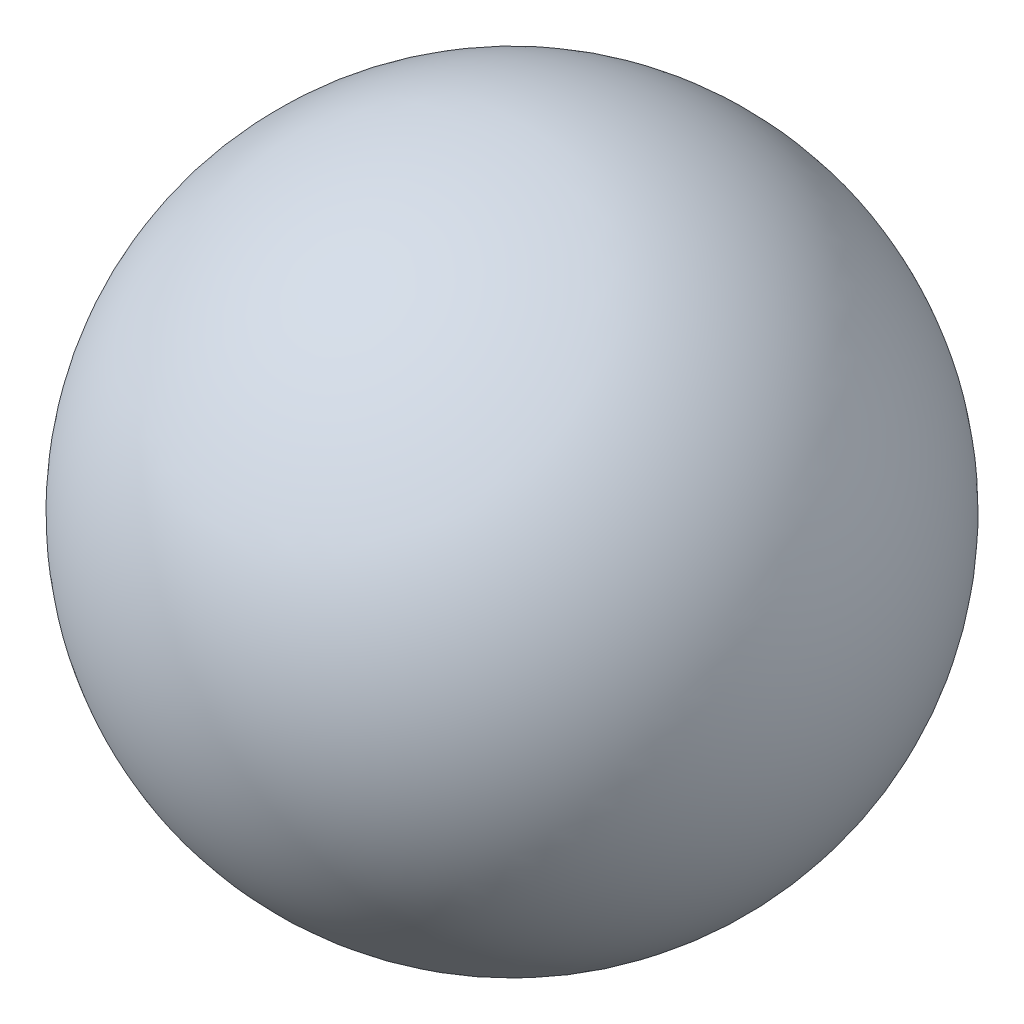
ISO-10303-21;
HEADER;
FILE_DESCRIPTION(('STEP AP214'),'2;1');
FILE_NAME('part.step','',(''),(''),'','','');
FILE_SCHEMA(('AUTOMOTIVE_DESIGN { 1 0 10303 214 1 1 1 1 }'));
ENDSEC;
DATA;
#1=APPLICATION_CONTEXT('core data for automotive mechanical design processes');
#2=APPLICATION_PROTOCOL_DEFINITION('international standard','automotive_design',2000,#1);
#3=PRODUCT_CONTEXT('',#1,'mechanical');
#4=PRODUCT('Part','Part','',(#3));
#5=PRODUCT_RELATED_PRODUCT_CATEGORY('part','',(#4));
#6=PRODUCT_DEFINITION_FORMATION('','',#4);
#7=PRODUCT_DEFINITION_CONTEXT('part definition',#1,'design');
#8=PRODUCT_DEFINITION('design','',#6,#7);
#9=PRODUCT_DEFINITION_SHAPE('','',#8);
#10=(LENGTH_UNIT() NAMED_UNIT(*) SI_UNIT(.MILLI.,.METRE.));
#11=(NAMED_UNIT(*) PLANE_ANGLE_UNIT() SI_UNIT($,.RADIAN.));
#12=(NAMED_UNIT(*) SI_UNIT($,.STERADIAN.) SOLID_ANGLE_UNIT());
#13=UNCERTAINTY_MEASURE_WITH_UNIT(LENGTH_MEASURE(1.E-05),#10,'distance_accuracy_value','');
#14=(GEOMETRIC_REPRESENTATION_CONTEXT(3) GLOBAL_UNCERTAINTY_ASSIGNED_CONTEXT((#13)) GLOBAL_UNIT_ASSIGNED_CONTEXT((#10,
#11,#12)) REPRESENTATION_CONTEXT('',''));
#15=CARTESIAN_POINT('',(0.,0.,0.));
#16=DIRECTION('',(0.,0.,1.));
#17=DIRECTION('',(1.,0.,0.));
#18=AXIS2_PLACEMENT_3D('',#15,#16,#17);
#19=CARTESIAN_POINT('',(-6.35252960510327,-2.,9.88472901076638));
#20=DIRECTION('',(0.,0.,1.));
#21=DIRECTION('',(1.,0.,0.));
#22=AXIS2_PLACEMENT_3D('',#19,#20,#21);
#23=SPHERICAL_SURFACE('',#22,1.05);
#24=CARTESIAN_POINT('',(-6.35252960510327,-2.,10.9347290107664));
#25=VERTEX_POINT('',#24);
#26=VERTEX_LOOP('',#25);
#27=FACE_BOUND('',#26,.T.);
#28=ADVANCED_FACE('F12',(#27),#23,.T.);
#29=CLOSED_SHELL('',(#28));
#30=MANIFOLD_SOLID_BREP('B1',#29);
#31=ADVANCED_BREP_SHAPE_REPRESENTATION('',(#18,#30),#14);
#32=SHAPE_DEFINITION_REPRESENTATION(#9,#31);
ENDSEC;
END-ISO-10303-21;
